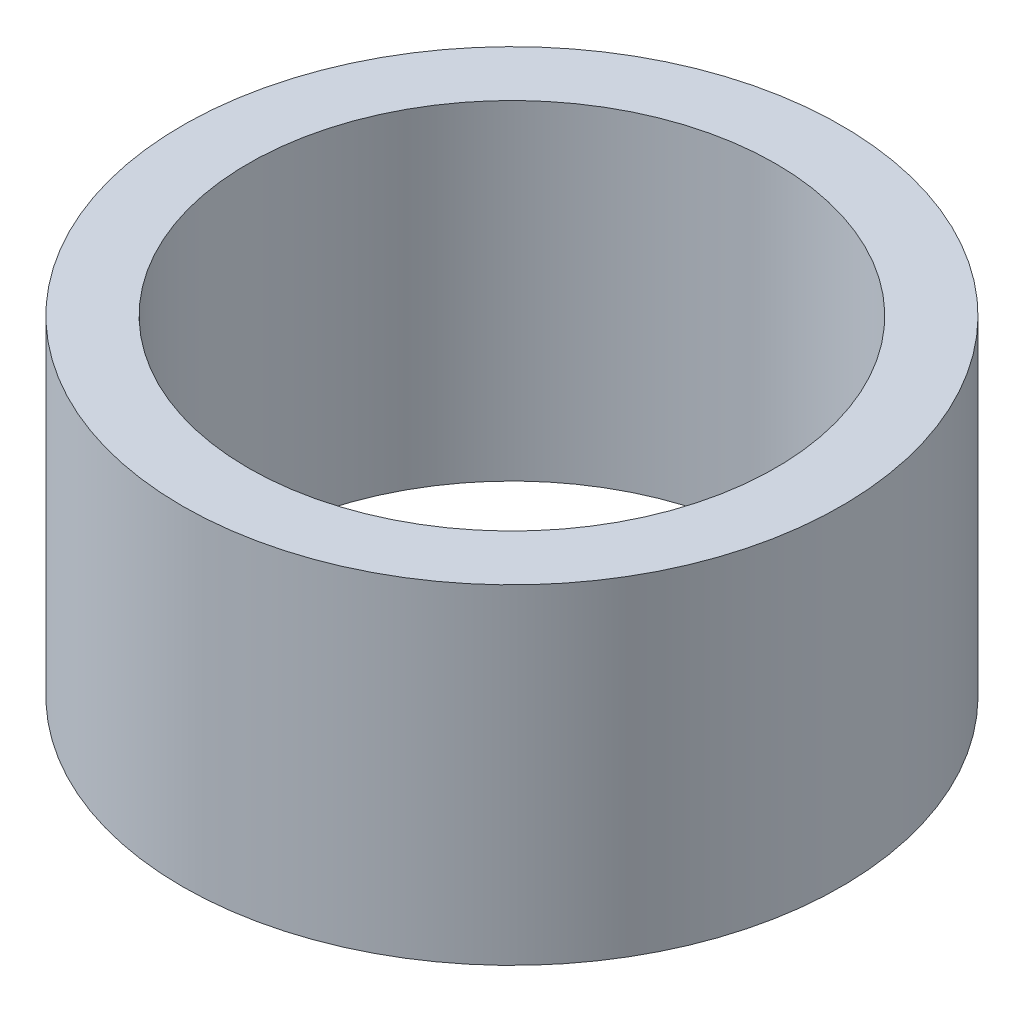
ISO-10303-21;
HEADER;
FILE_DESCRIPTION(('STEP AP214'),'2;1');
FILE_NAME('part.step','',(''),(''),'','','');
FILE_SCHEMA(('AUTOMOTIVE_DESIGN { 1 0 10303 214 1 1 1 1 }'));
ENDSEC;
DATA;
#1=APPLICATION_CONTEXT('core data for automotive mechanical design processes');
#2=APPLICATION_PROTOCOL_DEFINITION('international standard','automotive_design',2000,#1);
#3=PRODUCT_CONTEXT('',#1,'mechanical');
#4=PRODUCT('Part','Part','',(#3));
#5=PRODUCT_RELATED_PRODUCT_CATEGORY('part','',(#4));
#6=PRODUCT_DEFINITION_FORMATION('','',#4);
#7=PRODUCT_DEFINITION_CONTEXT('part definition',#1,'design');
#8=PRODUCT_DEFINITION('design','',#6,#7);
#9=PRODUCT_DEFINITION_SHAPE('','',#8);
#10=(LENGTH_UNIT() NAMED_UNIT(*) SI_UNIT(.MILLI.,.METRE.));
#11=(NAMED_UNIT(*) PLANE_ANGLE_UNIT() SI_UNIT($,.RADIAN.));
#12=(NAMED_UNIT(*) SI_UNIT($,.STERADIAN.) SOLID_ANGLE_UNIT());
#13=UNCERTAINTY_MEASURE_WITH_UNIT(LENGTH_MEASURE(1.E-05),#10,'distance_accuracy_value','');
#14=(GEOMETRIC_REPRESENTATION_CONTEXT(3) GLOBAL_UNCERTAINTY_ASSIGNED_CONTEXT((#13)) GLOBAL_UNIT_ASSIGNED_CONTEXT((#10,
#11,#12)) REPRESENTATION_CONTEXT('',''));
#15=CARTESIAN_POINT('',(0.,0.,0.));
#16=DIRECTION('',(0.,0.,1.));
#17=DIRECTION('',(1.,0.,0.));
#18=AXIS2_PLACEMENT_3D('',#15,#16,#17);
#19=CARTESIAN_POINT('',(0.,20.,0.));
#20=DIRECTION('',(0.,1.,0.));
#21=DIRECTION('',(0.,0.,1.));
#22=AXIS2_PLACEMENT_3D('',#19,#20,#21);
#23=PLANE('',#22);
#24=CARTESIAN_POINT('',(0.,20.,0.));
#25=DIRECTION('',(0.,1.,0.));
#26=DIRECTION('',(0.,0.,1.));
#27=AXIS2_PLACEMENT_3D('',#24,#25,#26);
#28=CIRCLE('',#27,20.);
#29=CARTESIAN_POINT('',(0.,20.,20.));
#30=VERTEX_POINT('',#29);
#31=EDGE_CURVE('E10',#30,#30,#28,.T.);
#32=ORIENTED_EDGE('',*,*,#31,.T.);
#33=EDGE_LOOP('',(#32));
#34=FACE_BOUND('',#33,.T.);
#35=CARTESIAN_POINT('',(0.,20.,0.));
#36=DIRECTION('',(0.,1.,0.));
#37=DIRECTION('',(0.,0.,1.));
#38=AXIS2_PLACEMENT_3D('',#35,#36,#37);
#39=CIRCLE('',#38,16.);
#40=CARTESIAN_POINT('',(0.,20.,16.));
#41=VERTEX_POINT('',#40);
#42=EDGE_CURVE('E40',#41,#41,#39,.T.);
#43=ORIENTED_EDGE('',*,*,#42,.F.);
#44=EDGE_LOOP('',(#43));
#45=FACE_BOUND('',#44,.T.);
#46=ADVANCED_FACE('F29',(#34,#45),#23,.T.);
#47=CARTESIAN_POINT('',(0.,0.,0.));
#48=DIRECTION('',(0.,1.,0.));
#49=DIRECTION('',(0.,0.,1.));
#50=AXIS2_PLACEMENT_3D('',#47,#48,#49);
#51=PLANE('',#50);
#52=CARTESIAN_POINT('',(0.,0.,0.));
#53=DIRECTION('',(0.,1.,0.));
#54=DIRECTION('',(0.,0.,1.));
#55=AXIS2_PLACEMENT_3D('',#52,#53,#54);
#56=CIRCLE('',#55,20.);
#57=CARTESIAN_POINT('',(0.,0.,20.));
#58=VERTEX_POINT('',#57);
#59=EDGE_CURVE('E33',#58,#58,#56,.T.);
#60=ORIENTED_EDGE('',*,*,#59,.F.);
#61=EDGE_LOOP('',(#60));
#62=FACE_BOUND('',#61,.T.);
#63=CARTESIAN_POINT('',(0.,0.,0.));
#64=DIRECTION('',(0.,1.,0.));
#65=DIRECTION('',(0.,0.,1.));
#66=AXIS2_PLACEMENT_3D('',#63,#64,#65);
#67=CIRCLE('',#66,16.);
#68=CARTESIAN_POINT('',(0.,0.,16.));
#69=VERTEX_POINT('',#68);
#70=EDGE_CURVE('E42',#69,#69,#67,.T.);
#71=ORIENTED_EDGE('',*,*,#70,.T.);
#72=EDGE_LOOP('',(#71));
#73=FACE_BOUND('',#72,.T.);
#74=ADVANCED_FACE('F52',(#62,#73),#51,.F.);
#75=CARTESIAN_POINT('',(0.,20.,0.));
#76=DIRECTION('',(0.,-1.,0.));
#77=DIRECTION('',(0.,0.,-1.));
#78=AXIS2_PLACEMENT_3D('',#75,#76,#77);
#79=CYLINDRICAL_SURFACE('',#78,20.);
#80=ORIENTED_EDGE('',*,*,#31,.F.);
#81=EDGE_LOOP('',(#80));
#82=FACE_BOUND('',#81,.T.);
#83=ORIENTED_EDGE('',*,*,#59,.T.);
#84=EDGE_LOOP('',(#83));
#85=FACE_BOUND('',#84,.T.);
#86=ADVANCED_FACE('F31',(#82,#85),#79,.T.);
#87=CARTESIAN_POINT('',(0.,20.,0.));
#88=DIRECTION('',(0.,-1.,0.));
#89=DIRECTION('',(0.,0.,-1.));
#90=AXIS2_PLACEMENT_3D('',#87,#88,#89);
#91=CYLINDRICAL_SURFACE('',#90,16.);
#92=ORIENTED_EDGE('',*,*,#42,.T.);
#93=EDGE_LOOP('',(#92));
#94=FACE_BOUND('',#93,.T.);
#95=ORIENTED_EDGE('',*,*,#70,.F.);
#96=EDGE_LOOP('',(#95));
#97=FACE_BOUND('',#96,.T.);
#98=ADVANCED_FACE('F48',(#94,#97),#91,.F.);
#99=CLOSED_SHELL('',(#46,#74,#86,#98));
#100=MANIFOLD_SOLID_BREP('B2',#99);
#101=ADVANCED_BREP_SHAPE_REPRESENTATION('',(#18,#100),#14);
#102=SHAPE_DEFINITION_REPRESENTATION(#9,#101);
ENDSEC;
END-ISO-10303-21;
